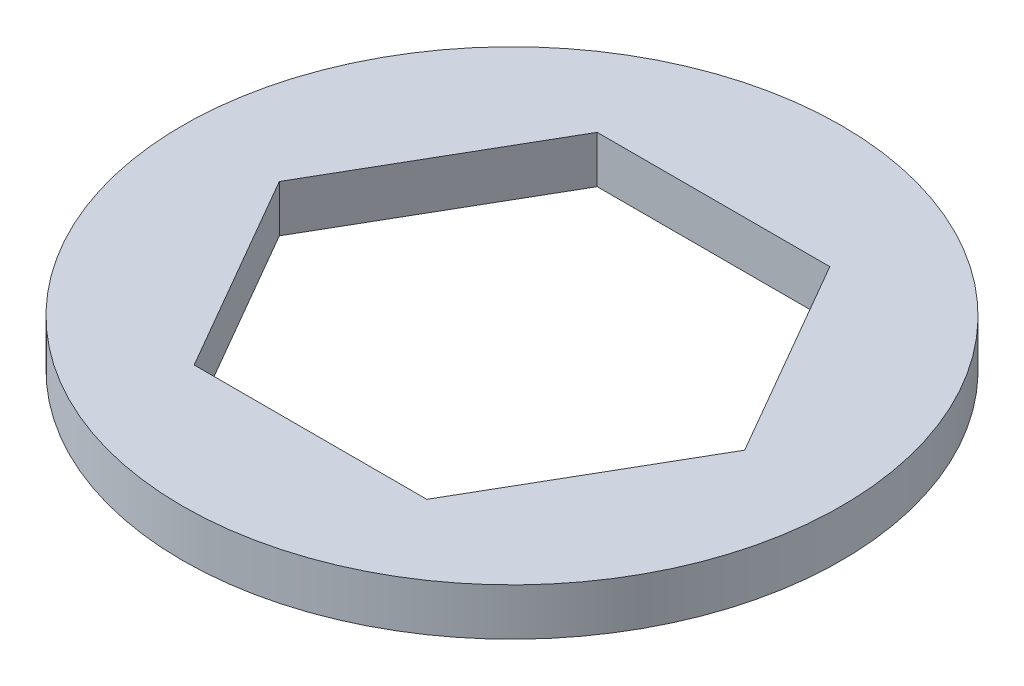
ISO-10303-21;
HEADER;
FILE_DESCRIPTION(('STEP AP214'),'2;1');
FILE_NAME('part.step','',(''),(''),'','','');
FILE_SCHEMA(('AUTOMOTIVE_DESIGN { 1 0 10303 214 1 1 1 1 }'));
ENDSEC;
DATA;
#1=APPLICATION_CONTEXT('core data for automotive mechanical design processes');
#2=APPLICATION_PROTOCOL_DEFINITION('international standard','automotive_design',2000,#1);
#3=PRODUCT_CONTEXT('',#1,'mechanical');
#4=PRODUCT('Part','Part','',(#3));
#5=PRODUCT_RELATED_PRODUCT_CATEGORY('part','',(#4));
#6=PRODUCT_DEFINITION_FORMATION('','',#4);
#7=PRODUCT_DEFINITION_CONTEXT('part definition',#1,'design');
#8=PRODUCT_DEFINITION('design','',#6,#7);
#9=PRODUCT_DEFINITION_SHAPE('','',#8);
#10=(LENGTH_UNIT() NAMED_UNIT(*) SI_UNIT(.MILLI.,.METRE.));
#11=(NAMED_UNIT(*) PLANE_ANGLE_UNIT() SI_UNIT($,.RADIAN.));
#12=(NAMED_UNIT(*) SI_UNIT($,.STERADIAN.) SOLID_ANGLE_UNIT());
#13=UNCERTAINTY_MEASURE_WITH_UNIT(LENGTH_MEASURE(1.E-05),#10,'distance_accuracy_value','');
#14=(GEOMETRIC_REPRESENTATION_CONTEXT(3) GLOBAL_UNCERTAINTY_ASSIGNED_CONTEXT((#13)) GLOBAL_UNIT_ASSIGNED_CONTEXT((#10,
#11,#12)) REPRESENTATION_CONTEXT('',''));
#15=CARTESIAN_POINT('',(0.,0.,0.));
#16=DIRECTION('',(0.,0.,1.));
#17=DIRECTION('',(1.,0.,0.));
#18=AXIS2_PLACEMENT_3D('',#15,#16,#17);
#19=CARTESIAN_POINT('',(0.,1.5875,0.));
#20=DIRECTION('',(0.,1.,0.));
#21=DIRECTION('',(0.,0.,1.));
#22=AXIS2_PLACEMENT_3D('',#19,#20,#21);
#23=PLANE('',#22);
#24=CARTESIAN_POINT('',(0.,1.5875,0.));
#25=DIRECTION('',(0.,1.,0.));
#26=DIRECTION('',(0.,0.,1.));
#27=AXIS2_PLACEMENT_3D('',#24,#25,#26);
#28=CIRCLE('',#27,11.1125);
#29=CARTESIAN_POINT('',(0.,1.5875,11.1125));
#30=VERTEX_POINT('',#29);
#31=EDGE_CURVE('E11',#30,#30,#28,.T.);
#32=ORIENTED_EDGE('',*,*,#31,.T.);
#33=EDGE_LOOP('',(#32));
#34=FACE_BOUND('',#33,.T.);
#35=DIRECTION('',(-0.5,0.,-0.866025403784439));
#36=VECTOR('',#35,1.);
#37=CARTESIAN_POINT('',(7.84561280801783,1.5875,0.));
#38=LINE('',#37,#36);
#39=CARTESIAN_POINT('',(7.84561280801783,1.5875,0.));
#40=VERTEX_POINT('',#39);
#41=CARTESIAN_POINT('',(3.9228064040089,1.5875,-6.79450000000002));
#42=VERTEX_POINT('',#41);
#43=EDGE_CURVE('E113',#40,#42,#38,.T.);
#44=ORIENTED_EDGE('',*,*,#43,.F.);
#45=DIRECTION('',(0.5,0.,-0.866025403784439));
#46=VECTOR('',#45,1.);
#47=CARTESIAN_POINT('',(3.92280640400891,1.5875,6.79450000000001));
#48=LINE('',#47,#46);
#49=CARTESIAN_POINT('',(3.92280640400891,1.5875,6.79450000000001));
#50=VERTEX_POINT('',#49);
#51=EDGE_CURVE('E104',#50,#40,#48,.T.);
#52=ORIENTED_EDGE('',*,*,#51,.F.);
#53=DIRECTION('',(1.,0.,0.));
#54=VECTOR('',#53,1.);
#55=CARTESIAN_POINT('',(-3.92280640400892,1.5875,6.79450000000001));
#56=LINE('',#55,#54);
#57=CARTESIAN_POINT('',(-3.92280640400892,1.5875,6.79450000000001));
#58=VERTEX_POINT('',#57);
#59=EDGE_CURVE('E140',#58,#50,#56,.T.);
#60=ORIENTED_EDGE('',*,*,#59,.F.);
#61=DIRECTION('',(0.5,0.,0.866025403784439));
#62=VECTOR('',#61,1.);
#63=CARTESIAN_POINT('',(-7.84561280801784,1.5875,0.));
#64=LINE('',#63,#62);
#65=CARTESIAN_POINT('',(-7.84561280801784,1.5875,0.));
#66=VERTEX_POINT('',#65);
#67=EDGE_CURVE('E137',#66,#58,#64,.T.);
#68=ORIENTED_EDGE('',*,*,#67,.F.);
#69=DIRECTION('',(-0.5,0.,0.866025403784439));
#70=VECTOR('',#69,1.);
#71=CARTESIAN_POINT('',(-3.92280640400892,1.5875,-6.79450000000002));
#72=LINE('',#71,#70);
#73=CARTESIAN_POINT('',(-3.92280640400892,1.5875,-6.79450000000002));
#74=VERTEX_POINT('',#73);
#75=EDGE_CURVE('E132',#74,#66,#72,.T.);
#76=ORIENTED_EDGE('',*,*,#75,.F.);
#77=DIRECTION('',(-1.,0.,0.));
#78=VECTOR('',#77,1.);
#79=CARTESIAN_POINT('',(3.9228064040089,1.5875,-6.79450000000002));
#80=LINE('',#79,#78);
#81=EDGE_CURVE('E126',#42,#74,#80,.T.);
#82=ORIENTED_EDGE('',*,*,#81,.F.);
#83=EDGE_LOOP('',(#44,#52,#60,#68,#76,#82));
#84=FACE_BOUND('',#83,.T.);
#85=ADVANCED_FACE('F38',(#34,#84),#23,.T.);
#86=CARTESIAN_POINT('',(0.,0.,0.));
#87=DIRECTION('',(0.,1.,0.));
#88=DIRECTION('',(0.,0.,1.));
#89=AXIS2_PLACEMENT_3D('',#86,#87,#88);
#90=PLANE('',#89);
#91=CARTESIAN_POINT('',(0.,0.,0.));
#92=DIRECTION('',(0.,1.,0.));
#93=DIRECTION('',(0.,0.,1.));
#94=AXIS2_PLACEMENT_3D('',#91,#92,#93);
#95=CIRCLE('',#94,11.1125);
#96=CARTESIAN_POINT('',(0.,0.,11.1125));
#97=VERTEX_POINT('',#96);
#98=EDGE_CURVE('E42',#97,#97,#95,.T.);
#99=ORIENTED_EDGE('',*,*,#98,.F.);
#100=EDGE_LOOP('',(#99));
#101=FACE_BOUND('',#100,.T.);
#102=DIRECTION('',(0.5,0.,-0.866025403784439));
#103=VECTOR('',#102,1.);
#104=CARTESIAN_POINT('',(3.92280640400891,0.,6.79450000000001));
#105=LINE('',#104,#103);
#106=CARTESIAN_POINT('',(3.92280640400891,0.,6.79450000000001));
#107=VERTEX_POINT('',#106);
#108=CARTESIAN_POINT('',(7.84561280801783,0.,0.));
#109=VERTEX_POINT('',#108);
#110=EDGE_CURVE('E67',#107,#109,#105,.T.);
#111=ORIENTED_EDGE('',*,*,#110,.T.);
#112=DIRECTION('',(-0.5,0.,-0.866025403784439));
#113=VECTOR('',#112,1.);
#114=CARTESIAN_POINT('',(7.84561280801783,0.,0.));
#115=LINE('',#114,#113);
#116=CARTESIAN_POINT('',(3.9228064040089,0.,-6.79450000000002));
#117=VERTEX_POINT('',#116);
#118=EDGE_CURVE('E120',#109,#117,#115,.T.);
#119=ORIENTED_EDGE('',*,*,#118,.T.);
#120=DIRECTION('',(-1.,0.,0.));
#121=VECTOR('',#120,1.);
#122=CARTESIAN_POINT('',(3.9228064040089,0.,-6.79450000000002));
#123=LINE('',#122,#121);
#124=CARTESIAN_POINT('',(-3.92280640400892,0.,-6.79450000000002));
#125=VERTEX_POINT('',#124);
#126=EDGE_CURVE('E147',#117,#125,#123,.T.);
#127=ORIENTED_EDGE('',*,*,#126,.T.);
#128=DIRECTION('',(-0.5,0.,0.866025403784439));
#129=VECTOR('',#128,1.);
#130=CARTESIAN_POINT('',(-3.92280640400892,0.,-6.79450000000002));
#131=LINE('',#130,#129);
#132=CARTESIAN_POINT('',(-7.84561280801784,0.,0.));
#133=VERTEX_POINT('',#132);
#134=EDGE_CURVE('E151',#125,#133,#131,.T.);
#135=ORIENTED_EDGE('',*,*,#134,.T.);
#136=DIRECTION('',(0.5,0.,0.866025403784439));
#137=VECTOR('',#136,1.);
#138=CARTESIAN_POINT('',(-7.84561280801784,0.,0.));
#139=LINE('',#138,#137);
#140=CARTESIAN_POINT('',(-3.92280640400892,0.,6.79450000000001));
#141=VERTEX_POINT('',#140);
#142=EDGE_CURVE('E154',#133,#141,#139,.T.);
#143=ORIENTED_EDGE('',*,*,#142,.T.);
#144=DIRECTION('',(1.,0.,0.));
#145=VECTOR('',#144,1.);
#146=CARTESIAN_POINT('',(-3.92280640400892,0.,6.79450000000001));
#147=LINE('',#146,#145);
#148=EDGE_CURVE('E114',#141,#107,#147,.T.);
#149=ORIENTED_EDGE('',*,*,#148,.T.);
#150=EDGE_LOOP('',(#111,#119,#127,#135,#143,#149));
#151=FACE_BOUND('',#150,.T.);
#152=ADVANCED_FACE('F177',(#101,#151),#90,.F.);
#153=CARTESIAN_POINT('',(0.,1.5875,0.));
#154=DIRECTION('',(0.,-1.,0.));
#155=DIRECTION('',(0.,0.,-1.));
#156=AXIS2_PLACEMENT_3D('',#153,#154,#155);
#157=CYLINDRICAL_SURFACE('',#156,11.1125);
#158=ORIENTED_EDGE('',*,*,#31,.F.);
#159=EDGE_LOOP('',(#158));
#160=FACE_BOUND('',#159,.T.);
#161=ORIENTED_EDGE('',*,*,#98,.T.);
#162=EDGE_LOOP('',(#161));
#163=FACE_BOUND('',#162,.T.);
#164=ADVANCED_FACE('F40',(#160,#163),#157,.T.);
#165=CARTESIAN_POINT('',(3.92280640400891,1.5875,6.79450000000001));
#166=DIRECTION('',(-0.866025403784439,0.,-0.5));
#167=DIRECTION('',(-0.5,0.,0.866025403784439));
#168=AXIS2_PLACEMENT_3D('',#165,#166,#167);
#169=PLANE('',#168);
#170=ORIENTED_EDGE('',*,*,#110,.F.);
#171=DIRECTION('',(0.,-1.,0.));
#172=VECTOR('',#171,1.);
#173=CARTESIAN_POINT('',(3.92280640400891,1.5875,6.79450000000001));
#174=LINE('',#173,#172);
#175=EDGE_CURVE('E108',#50,#107,#174,.T.);
#176=ORIENTED_EDGE('',*,*,#175,.F.);
#177=ORIENTED_EDGE('',*,*,#51,.T.);
#178=DIRECTION('',(0.,-1.,0.));
#179=VECTOR('',#178,1.);
#180=CARTESIAN_POINT('',(7.84561280801783,1.5875,0.));
#181=LINE('',#180,#179);
#182=EDGE_CURVE('E107',#40,#109,#181,.T.);
#183=ORIENTED_EDGE('',*,*,#182,.T.);
#184=EDGE_LOOP('',(#170,#176,#177,#183));
#185=FACE_BOUND('',#184,.T.);
#186=ADVANCED_FACE('F106',(#185),#169,.T.);
#187=CARTESIAN_POINT('',(7.84561280801783,1.5875,0.));
#188=DIRECTION('',(-0.866025403784439,0.,0.5));
#189=DIRECTION('',(0.5,0.,0.866025403784439));
#190=AXIS2_PLACEMENT_3D('',#187,#188,#189);
#191=PLANE('',#190);
#192=ORIENTED_EDGE('',*,*,#118,.F.);
#193=ORIENTED_EDGE('',*,*,#182,.F.);
#194=ORIENTED_EDGE('',*,*,#43,.T.);
#195=DIRECTION('',(0.,-1.,0.));
#196=VECTOR('',#195,1.);
#197=CARTESIAN_POINT('',(3.9228064040089,1.5875,-6.79450000000002));
#198=LINE('',#197,#196);
#199=EDGE_CURVE('E122',#42,#117,#198,.T.);
#200=ORIENTED_EDGE('',*,*,#199,.T.);
#201=EDGE_LOOP('',(#192,#193,#194,#200));
#202=FACE_BOUND('',#201,.T.);
#203=ADVANCED_FACE('F117',(#202),#191,.T.);
#204=CARTESIAN_POINT('',(3.9228064040089,1.5875,-6.79450000000002));
#205=DIRECTION('',(0.,0.,1.));
#206=DIRECTION('',(1.,0.,0.));
#207=AXIS2_PLACEMENT_3D('',#204,#205,#206);
#208=PLANE('',#207);
#209=ORIENTED_EDGE('',*,*,#126,.F.);
#210=ORIENTED_EDGE('',*,*,#199,.F.);
#211=ORIENTED_EDGE('',*,*,#81,.T.);
#212=DIRECTION('',(0.,-1.,0.));
#213=VECTOR('',#212,1.);
#214=CARTESIAN_POINT('',(-3.92280640400892,1.5875,-6.79450000000002));
#215=LINE('',#214,#213);
#216=EDGE_CURVE('E168',#74,#125,#215,.T.);
#217=ORIENTED_EDGE('',*,*,#216,.T.);
#218=EDGE_LOOP('',(#209,#210,#211,#217));
#219=FACE_BOUND('',#218,.T.);
#220=ADVANCED_FACE('F173',(#219),#208,.T.);
#221=CARTESIAN_POINT('',(-3.92280640400892,1.5875,-6.79450000000002));
#222=DIRECTION('',(0.866025403784439,0.,0.5));
#223=DIRECTION('',(0.5,0.,-0.866025403784439));
#224=AXIS2_PLACEMENT_3D('',#221,#222,#223);
#225=PLANE('',#224);
#226=ORIENTED_EDGE('',*,*,#134,.F.);
#227=ORIENTED_EDGE('',*,*,#216,.F.);
#228=ORIENTED_EDGE('',*,*,#75,.T.);
#229=DIRECTION('',(0.,-1.,0.));
#230=VECTOR('',#229,1.);
#231=CARTESIAN_POINT('',(-7.84561280801784,1.5875,0.));
#232=LINE('',#231,#230);
#233=EDGE_CURVE('E165',#66,#133,#232,.T.);
#234=ORIENTED_EDGE('',*,*,#233,.T.);
#235=EDGE_LOOP('',(#226,#227,#228,#234));
#236=FACE_BOUND('',#235,.T.);
#237=ADVANCED_FACE('F185',(#236),#225,.T.);
#238=CARTESIAN_POINT('',(-7.84561280801784,1.5875,0.));
#239=DIRECTION('',(0.866025403784439,0.,-0.5));
#240=DIRECTION('',(-0.5,0.,-0.866025403784439));
#241=AXIS2_PLACEMENT_3D('',#238,#239,#240);
#242=PLANE('',#241);
#243=ORIENTED_EDGE('',*,*,#142,.F.);
#244=ORIENTED_EDGE('',*,*,#233,.F.);
#245=ORIENTED_EDGE('',*,*,#67,.T.);
#246=DIRECTION('',(0.,-1.,0.));
#247=VECTOR('',#246,1.);
#248=CARTESIAN_POINT('',(-3.92280640400892,1.5875,6.79450000000001));
#249=LINE('',#248,#247);
#250=EDGE_CURVE('E56',#58,#141,#249,.T.);
#251=ORIENTED_EDGE('',*,*,#250,.T.);
#252=EDGE_LOOP('',(#243,#244,#245,#251));
#253=FACE_BOUND('',#252,.T.);
#254=ADVANCED_FACE('F183',(#253),#242,.T.);
#255=CARTESIAN_POINT('',(-3.92280640400892,1.5875,6.79450000000001));
#256=DIRECTION('',(0.,0.,-1.));
#257=DIRECTION('',(-1.,0.,0.));
#258=AXIS2_PLACEMENT_3D('',#255,#256,#257);
#259=PLANE('',#258);
#260=ORIENTED_EDGE('',*,*,#148,.F.);
#261=ORIENTED_EDGE('',*,*,#250,.F.);
#262=ORIENTED_EDGE('',*,*,#59,.T.);
#263=ORIENTED_EDGE('',*,*,#175,.T.);
#264=EDGE_LOOP('',(#260,#261,#262,#263));
#265=FACE_BOUND('',#264,.T.);
#266=ADVANCED_FACE('F179',(#265),#259,.T.);
#267=CLOSED_SHELL('',(#85,#152,#164,#186,#203,#220,#237,#254,#266));
#268=MANIFOLD_SOLID_BREP('B2',#267);
#269=ADVANCED_BREP_SHAPE_REPRESENTATION('',(#18,#268),#14);
#270=SHAPE_DEFINITION_REPRESENTATION(#9,#269);
ENDSEC;
END-ISO-10303-21;
